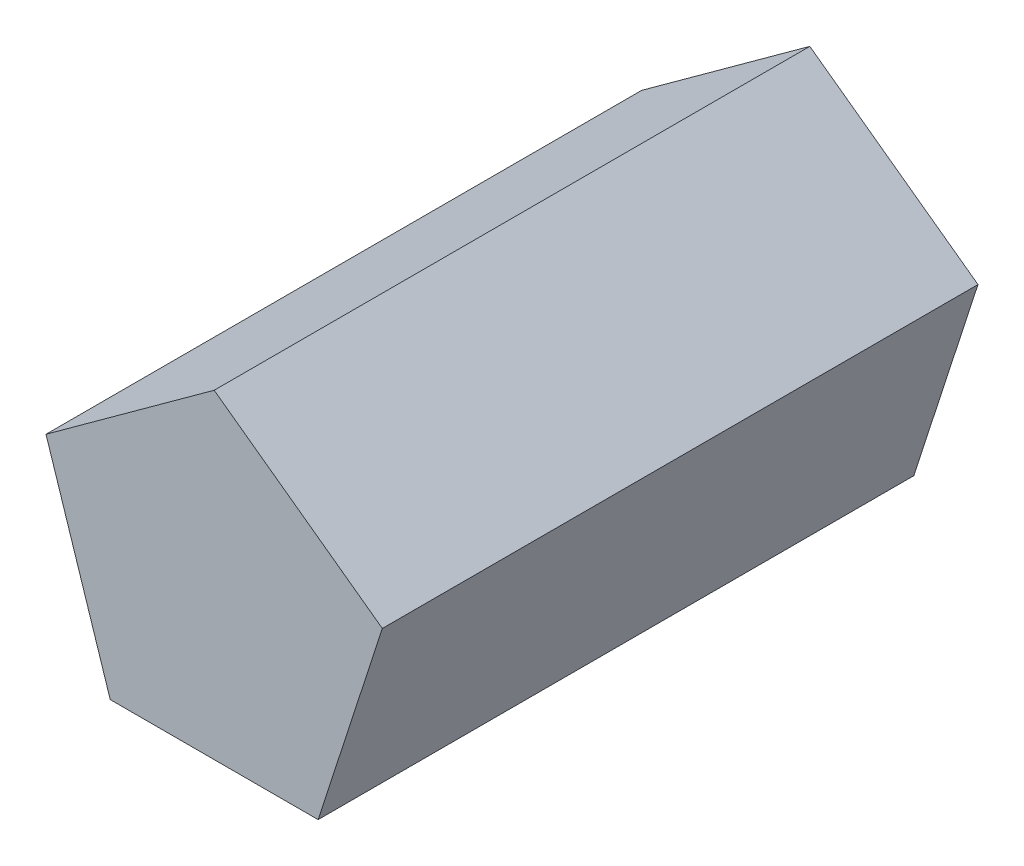
ISO-10303-21;
HEADER;
FILE_DESCRIPTION(('STEP AP214'),'2;1');
FILE_NAME('part.step','',(''),(''),'','','');
FILE_SCHEMA(('AUTOMOTIVE_DESIGN { 1 0 10303 214 1 1 1 1 }'));
ENDSEC;
DATA;
#1=APPLICATION_CONTEXT('core data for automotive mechanical design processes');
#2=APPLICATION_PROTOCOL_DEFINITION('international standard','automotive_design',2000,#1);
#3=PRODUCT_CONTEXT('',#1,'mechanical');
#4=PRODUCT('Part','Part','',(#3));
#5=PRODUCT_RELATED_PRODUCT_CATEGORY('part','',(#4));
#6=PRODUCT_DEFINITION_FORMATION('','',#4);
#7=PRODUCT_DEFINITION_CONTEXT('part definition',#1,'design');
#8=PRODUCT_DEFINITION('design','',#6,#7);
#9=PRODUCT_DEFINITION_SHAPE('','',#8);
#10=(LENGTH_UNIT() NAMED_UNIT(*) SI_UNIT(.MILLI.,.METRE.));
#11=(NAMED_UNIT(*) PLANE_ANGLE_UNIT() SI_UNIT($,.RADIAN.));
#12=(NAMED_UNIT(*) SI_UNIT($,.STERADIAN.) SOLID_ANGLE_UNIT());
#13=UNCERTAINTY_MEASURE_WITH_UNIT(LENGTH_MEASURE(1.E-05),#10,'distance_accuracy_value','');
#14=(GEOMETRIC_REPRESENTATION_CONTEXT(3) GLOBAL_UNCERTAINTY_ASSIGNED_CONTEXT((#13)) GLOBAL_UNIT_ASSIGNED_CONTEXT((#10,
#11,#12)) REPRESENTATION_CONTEXT('',''));
#15=CARTESIAN_POINT('',(0.,0.,0.));
#16=DIRECTION('',(0.,0.,1.));
#17=DIRECTION('',(1.,0.,0.));
#18=AXIS2_PLACEMENT_3D('',#15,#16,#17);
#19=CARTESIAN_POINT('',(-27.9197994838925,-38.42830723281,160.));
#20=DIRECTION('',(0.,1.,0.));
#21=DIRECTION('',(0.,0.,1.));
#22=AXIS2_PLACEMENT_3D('',#19,#20,#21);
#23=PLANE('',#22);
#24=DIRECTION('',(1.,0.,0.));
#25=VECTOR('',#24,1.);
#26=CARTESIAN_POINT('',(-27.9197994838925,-38.42830723281,0.));
#27=LINE('',#26,#25);
#28=CARTESIAN_POINT('',(-27.9197994838925,-38.42830723281,0.));
#29=VERTEX_POINT('',#28);
#30=CARTESIAN_POINT('',(27.9197994838925,-38.42830723281,0.));
#31=VERTEX_POINT('',#30);
#32=EDGE_CURVE('E107',#29,#31,#27,.T.);
#33=ORIENTED_EDGE('',*,*,#32,.T.);
#34=DIRECTION('',(0.,0.,-1.));
#35=VECTOR('',#34,1.);
#36=CARTESIAN_POINT('',(27.9197994838925,-38.42830723281,160.));
#37=LINE('',#36,#35);
#38=CARTESIAN_POINT('',(27.9197994838925,-38.42830723281,160.));
#39=VERTEX_POINT('',#38);
#40=EDGE_CURVE('E11',#39,#31,#37,.T.);
#41=ORIENTED_EDGE('',*,*,#40,.F.);
#42=DIRECTION('',(1.,0.,0.));
#43=VECTOR('',#42,1.);
#44=CARTESIAN_POINT('',(-27.9197994838925,-38.42830723281,160.));
#45=LINE('',#44,#43);
#46=CARTESIAN_POINT('',(-27.9197994838925,-38.42830723281,160.));
#47=VERTEX_POINT('',#46);
#48=EDGE_CURVE('E115',#47,#39,#45,.T.);
#49=ORIENTED_EDGE('',*,*,#48,.F.);
#50=DIRECTION('',(0.,0.,-1.));
#51=VECTOR('',#50,1.);
#52=CARTESIAN_POINT('',(-27.9197994838925,-38.42830723281,160.));
#53=LINE('',#52,#51);
#54=EDGE_CURVE('E103',#47,#29,#53,.T.);
#55=ORIENTED_EDGE('',*,*,#54,.T.);
#56=EDGE_LOOP('',(#33,#41,#49,#55));
#57=FACE_BOUND('',#56,.T.);
#58=ADVANCED_FACE('F33',(#57),#23,.F.);
#59=CARTESIAN_POINT('',(27.9197994838925,-38.42830723281,160.));
#60=DIRECTION('',(-0.951056516295154,0.309016994374947,0.));
#61=DIRECTION('',(-0.309016994374947,-0.951056516295154,0.));
#62=AXIS2_PLACEMENT_3D('',#59,#60,#61);
#63=PLANE('',#62);
#64=DIRECTION('',(0.309016994374947,0.951056516295154,0.));
#65=VECTOR('',#64,1.);
#66=CARTESIAN_POINT('',(27.9197994838925,-38.42830723281,0.));
#67=LINE('',#66,#65);
#68=CARTESIAN_POINT('',(45.1751845240198,14.67830723281,0.));
#69=VERTEX_POINT('',#68);
#70=EDGE_CURVE('E110',#31,#69,#67,.T.);
#71=ORIENTED_EDGE('',*,*,#70,.T.);
#72=DIRECTION('',(0.,0.,-1.));
#73=VECTOR('',#72,1.);
#74=CARTESIAN_POINT('',(45.1751845240198,14.67830723281,160.));
#75=LINE('',#74,#73);
#76=CARTESIAN_POINT('',(45.1751845240198,14.67830723281,160.));
#77=VERTEX_POINT('',#76);
#78=EDGE_CURVE('E41',#77,#69,#75,.T.);
#79=ORIENTED_EDGE('',*,*,#78,.F.);
#80=DIRECTION('',(0.309016994374947,0.951056516295154,0.));
#81=VECTOR('',#80,1.);
#82=CARTESIAN_POINT('',(27.9197994838925,-38.42830723281,160.));
#83=LINE('',#82,#81);
#84=EDGE_CURVE('E83',#39,#77,#83,.T.);
#85=ORIENTED_EDGE('',*,*,#84,.F.);
#86=ORIENTED_EDGE('',*,*,#40,.T.);
#87=EDGE_LOOP('',(#71,#79,#85,#86));
#88=FACE_BOUND('',#87,.T.);
#89=ADVANCED_FACE('F134',(#88),#63,.F.);
#90=CARTESIAN_POINT('',(45.1751845240198,14.67830723281,160.));
#91=DIRECTION('',(-0.587785252292473,-0.809016994374948,0.));
#92=DIRECTION('',(0.809016994374948,-0.587785252292473,0.));
#93=AXIS2_PLACEMENT_3D('',#90,#91,#92);
#94=PLANE('',#93);
#95=DIRECTION('',(-0.809016994374948,0.587785252292473,0.));
#96=VECTOR('',#95,1.);
#97=CARTESIAN_POINT('',(45.1751845240198,14.67830723281,0.));
#98=LINE('',#97,#96);
#99=CARTESIAN_POINT('',(0.,47.5,0.));
#100=VERTEX_POINT('',#99);
#101=EDGE_CURVE('E98',#69,#100,#98,.T.);
#102=ORIENTED_EDGE('',*,*,#101,.T.);
#103=DIRECTION('',(0.,0.,-1.));
#104=VECTOR('',#103,1.);
#105=CARTESIAN_POINT('',(0.,47.5,160.));
#106=LINE('',#105,#104);
#107=CARTESIAN_POINT('',(0.,47.5,160.));
#108=VERTEX_POINT('',#107);
#109=EDGE_CURVE('E95',#108,#100,#106,.T.);
#110=ORIENTED_EDGE('',*,*,#109,.F.);
#111=DIRECTION('',(-0.809016994374948,0.587785252292473,0.));
#112=VECTOR('',#111,1.);
#113=CARTESIAN_POINT('',(45.1751845240198,14.67830723281,160.));
#114=LINE('',#113,#112);
#115=EDGE_CURVE('E87',#77,#108,#114,.T.);
#116=ORIENTED_EDGE('',*,*,#115,.F.);
#117=ORIENTED_EDGE('',*,*,#78,.T.);
#118=EDGE_LOOP('',(#102,#110,#116,#117));
#119=FACE_BOUND('',#118,.T.);
#120=ADVANCED_FACE('F96',(#119),#94,.F.);
#121=CARTESIAN_POINT('',(0.,47.5,160.));
#122=DIRECTION('',(0.587785252292473,-0.809016994374948,0.));
#123=DIRECTION('',(0.809016994374948,0.587785252292473,0.));
#124=AXIS2_PLACEMENT_3D('',#121,#122,#123);
#125=PLANE('',#124);
#126=DIRECTION('',(-0.809016994374948,-0.587785252292473,0.));
#127=VECTOR('',#126,1.);
#128=CARTESIAN_POINT('',(0.,47.5,0.));
#129=LINE('',#128,#127);
#130=CARTESIAN_POINT('',(-45.1751845240198,14.67830723281,0.));
#131=VERTEX_POINT('',#130);
#132=EDGE_CURVE('E69',#100,#131,#129,.T.);
#133=ORIENTED_EDGE('',*,*,#132,.T.);
#134=DIRECTION('',(0.,0.,-1.));
#135=VECTOR('',#134,1.);
#136=CARTESIAN_POINT('',(-45.1751845240198,14.67830723281,160.));
#137=LINE('',#136,#135);
#138=CARTESIAN_POINT('',(-45.1751845240198,14.67830723281,160.));
#139=VERTEX_POINT('',#138);
#140=EDGE_CURVE('E99',#139,#131,#137,.T.);
#141=ORIENTED_EDGE('',*,*,#140,.F.);
#142=DIRECTION('',(-0.809016994374948,-0.587785252292473,0.));
#143=VECTOR('',#142,1.);
#144=CARTESIAN_POINT('',(0.,47.5,160.));
#145=LINE('',#144,#143);
#146=EDGE_CURVE('E91',#108,#139,#145,.T.);
#147=ORIENTED_EDGE('',*,*,#146,.F.);
#148=ORIENTED_EDGE('',*,*,#109,.T.);
#149=EDGE_LOOP('',(#133,#141,#147,#148));
#150=FACE_BOUND('',#149,.T.);
#151=ADVANCED_FACE('F101',(#150),#125,.F.);
#152=CARTESIAN_POINT('',(-45.1751845240198,14.67830723281,160.));
#153=DIRECTION('',(0.951056516295153,0.309016994374948,0.));
#154=DIRECTION('',(-0.309016994374948,0.951056516295154,0.));
#155=AXIS2_PLACEMENT_3D('',#152,#153,#154);
#156=PLANE('',#155);
#157=DIRECTION('',(0.309016994374948,-0.951056516295153,0.));
#158=VECTOR('',#157,1.);
#159=CARTESIAN_POINT('',(-45.1751845240198,14.67830723281,0.));
#160=LINE('',#159,#158);
#161=EDGE_CURVE('E75',#131,#29,#160,.T.);
#162=ORIENTED_EDGE('',*,*,#161,.T.);
#163=ORIENTED_EDGE('',*,*,#54,.F.);
#164=DIRECTION('',(0.309016994374948,-0.951056516295153,0.));
#165=VECTOR('',#164,1.);
#166=CARTESIAN_POINT('',(-45.1751845240198,14.67830723281,160.));
#167=LINE('',#166,#165);
#168=EDGE_CURVE('E49',#139,#47,#167,.T.);
#169=ORIENTED_EDGE('',*,*,#168,.F.);
#170=ORIENTED_EDGE('',*,*,#140,.T.);
#171=EDGE_LOOP('',(#162,#163,#169,#170));
#172=FACE_BOUND('',#171,.T.);
#173=ADVANCED_FACE('F123',(#172),#156,.F.);
#174=CARTESIAN_POINT('',(0.,0.,160.));
#175=DIRECTION('',(0.,0.,1.));
#176=DIRECTION('',(1.,0.,0.));
#177=AXIS2_PLACEMENT_3D('',#174,#175,#176);
#178=PLANE('',#177);
#179=ORIENTED_EDGE('',*,*,#48,.T.);
#180=ORIENTED_EDGE('',*,*,#84,.T.);
#181=ORIENTED_EDGE('',*,*,#115,.T.);
#182=ORIENTED_EDGE('',*,*,#146,.T.);
#183=ORIENTED_EDGE('',*,*,#168,.T.);
#184=EDGE_LOOP('',(#179,#180,#181,#182,#183));
#185=FACE_BOUND('',#184,.T.);
#186=ADVANCED_FACE('F89',(#185),#178,.T.);
#187=CARTESIAN_POINT('',(0.,0.,0.));
#188=DIRECTION('',(0.,0.,1.));
#189=DIRECTION('',(1.,0.,0.));
#190=AXIS2_PLACEMENT_3D('',#187,#188,#189);
#191=PLANE('',#190);
#192=ORIENTED_EDGE('',*,*,#32,.F.);
#193=ORIENTED_EDGE('',*,*,#161,.F.);
#194=ORIENTED_EDGE('',*,*,#132,.F.);
#195=ORIENTED_EDGE('',*,*,#101,.F.);
#196=ORIENTED_EDGE('',*,*,#70,.F.);
#197=EDGE_LOOP('',(#192,#193,#194,#195,#196));
#198=FACE_BOUND('',#197,.T.);
#199=ADVANCED_FACE('F119',(#198),#191,.F.);
#200=CLOSED_SHELL('',(#58,#89,#120,#151,#173,#186,#199));
#201=MANIFOLD_SOLID_BREP('B2',#200);
#202=ADVANCED_BREP_SHAPE_REPRESENTATION('',(#18,#201),#14);
#203=SHAPE_DEFINITION_REPRESENTATION(#9,#202);
ENDSEC;
END-ISO-10303-21;
